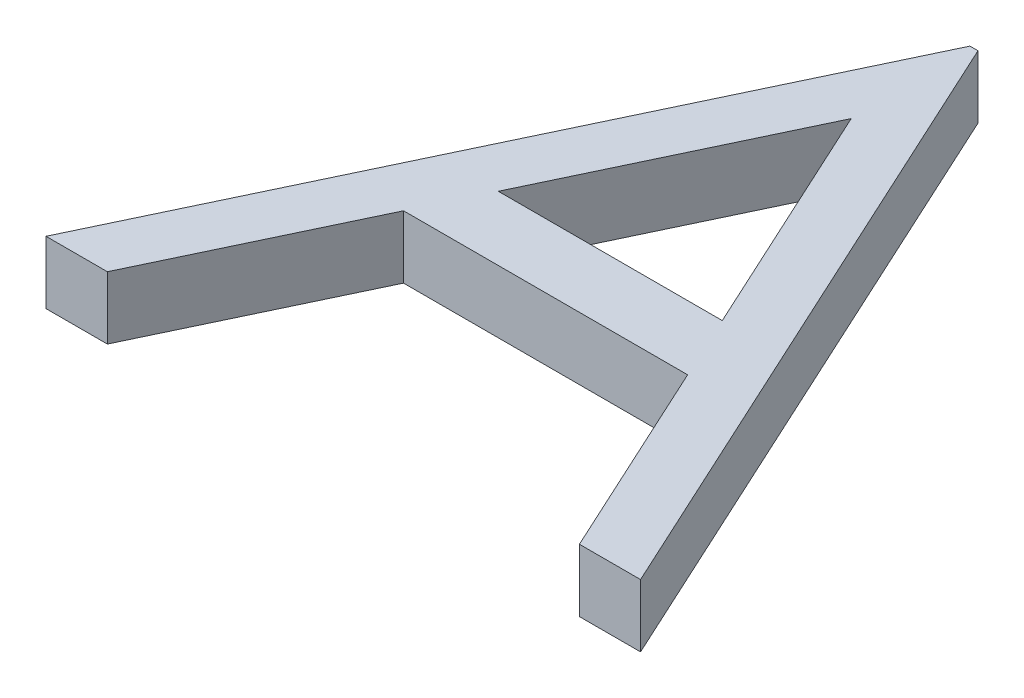
ISO-10303-21;
HEADER;
FILE_DESCRIPTION(('STEP AP214'),'2;1');
FILE_NAME('part.step','',(''),(''),'','','');
FILE_SCHEMA(('AUTOMOTIVE_DESIGN { 1 0 10303 214 1 1 1 1 }'));
ENDSEC;
DATA;
#1=APPLICATION_CONTEXT('core data for automotive mechanical design processes');
#2=APPLICATION_PROTOCOL_DEFINITION('international standard','automotive_design',2000,#1);
#3=PRODUCT_CONTEXT('',#1,'mechanical');
#4=PRODUCT('Part','Part','',(#3));
#5=PRODUCT_RELATED_PRODUCT_CATEGORY('part','',(#4));
#6=PRODUCT_DEFINITION_FORMATION('','',#4);
#7=PRODUCT_DEFINITION_CONTEXT('part definition',#1,'design');
#8=PRODUCT_DEFINITION('design','',#6,#7);
#9=PRODUCT_DEFINITION_SHAPE('','',#8);
#10=(LENGTH_UNIT() NAMED_UNIT(*) SI_UNIT(.MILLI.,.METRE.));
#11=(NAMED_UNIT(*) PLANE_ANGLE_UNIT() SI_UNIT($,.RADIAN.));
#12=(NAMED_UNIT(*) SI_UNIT($,.STERADIAN.) SOLID_ANGLE_UNIT());
#13=UNCERTAINTY_MEASURE_WITH_UNIT(LENGTH_MEASURE(1.E-05),#10,'distance_accuracy_value','');
#14=(GEOMETRIC_REPRESENTATION_CONTEXT(3) GLOBAL_UNCERTAINTY_ASSIGNED_CONTEXT((#13)) GLOBAL_UNIT_ASSIGNED_CONTEXT((#10,
#11,#12)) REPRESENTATION_CONTEXT('',''));
#15=CARTESIAN_POINT('',(0.,0.,0.));
#16=DIRECTION('',(0.,0.,1.));
#17=DIRECTION('',(1.,0.,0.));
#18=AXIS2_PLACEMENT_3D('',#15,#16,#17);
#19=CARTESIAN_POINT('',(0.,2.54,0.));
#20=DIRECTION('',(0.,1.,0.));
#21=DIRECTION('',(0.,0.,1.));
#22=AXIS2_PLACEMENT_3D('',#19,#20,#21);
#23=PLANE('',#22);
#24=DIRECTION('',(1.,0.,0.));
#25=VECTOR('',#24,1.);
#26=CARTESIAN_POINT('',(13.3512820512821,2.54,-25.4));
#27=LINE('',#26,#25);
#28=CARTESIAN_POINT('',(13.3512820512821,2.54,-25.4));
#29=VERTEX_POINT('',#28);
#30=CARTESIAN_POINT('',(13.6769230769231,2.54,-25.4));
#31=VERTEX_POINT('',#30);
#32=EDGE_CURVE('E160',#29,#31,#27,.T.);
#33=ORIENTED_EDGE('',*,*,#32,.F.);
#34=DIRECTION('',(0.428584206872173,0.,-0.903501841514311));
#35=VECTOR('',#34,1.);
#36=CARTESIAN_POINT('',(1.3025641025641,2.54,0.));
#37=LINE('',#36,#35);
#38=CARTESIAN_POINT('',(1.3025641025641,2.54,0.));
#39=VERTEX_POINT('',#38);
#40=EDGE_CURVE('E189',#39,#29,#37,.T.);
#41=ORIENTED_EDGE('',*,*,#40,.F.);
#42=DIRECTION('',(-1.,0.,0.));
#43=VECTOR('',#42,1.);
#44=CARTESIAN_POINT('',(3.79066506410256,2.54,0.));
#45=LINE('',#44,#43);
#46=CARTESIAN_POINT('',(3.79066506410256,2.54,0.));
#47=VERTEX_POINT('',#46);
#48=EDGE_CURVE('E185',#47,#39,#45,.T.);
#49=ORIENTED_EDGE('',*,*,#48,.F.);
#50=DIRECTION('',(-0.428596026355544,0.,0.903496234741594));
#51=VECTOR('',#50,1.);
#52=CARTESIAN_POINT('',(7.6525641025641,2.54,-8.14102564102564));
#53=LINE('',#52,#51);
#54=CARTESIAN_POINT('',(7.6525641025641,2.54,-8.14102564102564));
#55=VERTEX_POINT('',#54);
#56=EDGE_CURVE('E181',#55,#47,#53,.T.);
#57=ORIENTED_EDGE('',*,*,#56,.F.);
#58=DIRECTION('',(-1.,0.,0.));
#59=VECTOR('',#58,1.);
#60=CARTESIAN_POINT('',(19.1670272435897,2.54,-8.14102564102564));
#61=LINE('',#60,#59);
#62=CARTESIAN_POINT('',(19.1670272435897,2.54,-8.14102564102564));
#63=VERTEX_POINT('',#62);
#64=EDGE_CURVE('E177',#63,#55,#61,.T.);
#65=ORIENTED_EDGE('',*,*,#64,.F.);
#66=DIRECTION('',(-0.418842224744608,0.,-0.90805902383655));
#67=VECTOR('',#66,1.);
#68=CARTESIAN_POINT('',(22.9220753205128,2.54,0.));
#69=LINE('',#68,#67);
#70=CARTESIAN_POINT('',(22.9220753205128,2.54,0.));
#71=VERTEX_POINT('',#70);
#72=EDGE_CURVE('E173',#71,#63,#69,.T.);
#73=ORIENTED_EDGE('',*,*,#72,.F.);
#74=DIRECTION('',(-1.,0.,0.));
#75=VECTOR('',#74,1.);
#76=CARTESIAN_POINT('',(25.4,2.54,0.));
#77=LINE('',#76,#75);
#78=CARTESIAN_POINT('',(25.4,2.54,0.));
#79=VERTEX_POINT('',#78);
#80=EDGE_CURVE('E169',#79,#71,#77,.T.);
#81=ORIENTED_EDGE('',*,*,#80,.F.);
#82=DIRECTION('',(0.419058177461747,0.,0.907959384500452));
#83=VECTOR('',#82,1.);
#84=CARTESIAN_POINT('',(13.6769230769231,2.54,-25.4));
#85=LINE('',#84,#83);
#86=EDGE_CURVE('E164',#31,#79,#85,.T.);
#87=ORIENTED_EDGE('',*,*,#86,.F.);
#88=EDGE_LOOP('',(#33,#41,#49,#57,#65,#73,#81,#87));
#89=FACE_BOUND('',#88,.T.);
#90=DIRECTION('',(-0.428351119156279,0.,0.903612371936973));
#91=VECTOR('',#90,1.);
#92=CARTESIAN_POINT('',(13.4886618589744,2.54,-20.4492387820513));
#93=LINE('',#92,#91);
#94=CARTESIAN_POINT('',(13.4886618589744,2.54,-20.4492387820513));
#95=VERTEX_POINT('',#94);
#96=CARTESIAN_POINT('',(8.88898237179487,2.54,-10.7461538461538));
#97=VERTEX_POINT('',#96);
#98=EDGE_CURVE('E133',#95,#97,#93,.T.);
#99=ORIENTED_EDGE('',*,*,#98,.F.);
#100=DIRECTION('',(-0.418997788826975,0.,-0.907987253742092));
#101=VECTOR('',#100,1.);
#102=CARTESIAN_POINT('',(17.9662259615385,2.54,-10.7461538461538));
#103=LINE('',#102,#101);
#104=CARTESIAN_POINT('',(17.9662259615385,2.54,-10.7461538461538));
#105=VERTEX_POINT('',#104);
#106=EDGE_CURVE('E124',#105,#95,#103,.T.);
#107=ORIENTED_EDGE('',*,*,#106,.F.);
#108=DIRECTION('',(1.,0.,0.));
#109=VECTOR('',#108,1.);
#110=CARTESIAN_POINT('',(8.88898237179487,2.54,-10.7461538461538));
#111=LINE('',#110,#109);
#112=EDGE_CURVE('E143',#97,#105,#111,.T.);
#113=ORIENTED_EDGE('',*,*,#112,.F.);
#114=EDGE_LOOP('',(#99,#107,#113));
#115=FACE_BOUND('',#114,.T.);
#116=ADVANCED_FACE('F39',(#89,#115),#23,.T.);
#117=CARTESIAN_POINT('',(0.,0.,0.));
#118=DIRECTION('',(0.,1.,0.));
#119=DIRECTION('',(0.,0.,1.));
#120=AXIS2_PLACEMENT_3D('',#117,#118,#119);
#121=PLANE('',#120);
#122=DIRECTION('',(1.,0.,0.));
#123=VECTOR('',#122,1.);
#124=CARTESIAN_POINT('',(13.3512820512821,0.,-25.4));
#125=LINE('',#124,#123);
#126=CARTESIAN_POINT('',(13.3512820512821,0.,-25.4));
#127=VERTEX_POINT('',#126);
#128=CARTESIAN_POINT('',(13.6769230769231,0.,-25.4));
#129=VERTEX_POINT('',#128);
#130=EDGE_CURVE('E141',#127,#129,#125,.T.);
#131=ORIENTED_EDGE('',*,*,#130,.T.);
#132=DIRECTION('',(0.419058177461747,0.,0.907959384500452));
#133=VECTOR('',#132,1.);
#134=CARTESIAN_POINT('',(13.6769230769231,0.,-25.4));
#135=LINE('',#134,#133);
#136=CARTESIAN_POINT('',(25.4,0.,0.));
#137=VERTEX_POINT('',#136);
#138=EDGE_CURVE('E196',#129,#137,#135,.T.);
#139=ORIENTED_EDGE('',*,*,#138,.T.);
#140=DIRECTION('',(-1.,0.,0.));
#141=VECTOR('',#140,1.);
#142=CARTESIAN_POINT('',(25.4,0.,0.));
#143=LINE('',#142,#141);
#144=CARTESIAN_POINT('',(22.9220753205128,0.,0.));
#145=VERTEX_POINT('',#144);
#146=EDGE_CURVE('E200',#137,#145,#143,.T.);
#147=ORIENTED_EDGE('',*,*,#146,.T.);
#148=DIRECTION('',(-0.418842224744608,0.,-0.90805902383655));
#149=VECTOR('',#148,1.);
#150=CARTESIAN_POINT('',(22.9220753205128,0.,0.));
#151=LINE('',#150,#149);
#152=CARTESIAN_POINT('',(19.1670272435897,0.,-8.14102564102564));
#153=VERTEX_POINT('',#152);
#154=EDGE_CURVE('E204',#145,#153,#151,.T.);
#155=ORIENTED_EDGE('',*,*,#154,.T.);
#156=DIRECTION('',(-1.,0.,0.));
#157=VECTOR('',#156,1.);
#158=CARTESIAN_POINT('',(19.1670272435897,0.,-8.14102564102564));
#159=LINE('',#158,#157);
#160=CARTESIAN_POINT('',(7.6525641025641,0.,-8.14102564102564));
#161=VERTEX_POINT('',#160);
#162=EDGE_CURVE('E208',#153,#161,#159,.T.);
#163=ORIENTED_EDGE('',*,*,#162,.T.);
#164=DIRECTION('',(-0.428596026355544,0.,0.903496234741594));
#165=VECTOR('',#164,1.);
#166=CARTESIAN_POINT('',(7.6525641025641,0.,-8.14102564102564));
#167=LINE('',#166,#165);
#168=CARTESIAN_POINT('',(3.79066506410256,0.,0.));
#169=VERTEX_POINT('',#168);
#170=EDGE_CURVE('E212',#161,#169,#167,.T.);
#171=ORIENTED_EDGE('',*,*,#170,.T.);
#172=DIRECTION('',(-1.,0.,0.));
#173=VECTOR('',#172,1.);
#174=CARTESIAN_POINT('',(3.79066506410256,0.,0.));
#175=LINE('',#174,#173);
#176=CARTESIAN_POINT('',(1.3025641025641,0.,0.));
#177=VERTEX_POINT('',#176);
#178=EDGE_CURVE('E216',#169,#177,#175,.T.);
#179=ORIENTED_EDGE('',*,*,#178,.T.);
#180=DIRECTION('',(0.428584206872173,0.,-0.903501841514311));
#181=VECTOR('',#180,1.);
#182=CARTESIAN_POINT('',(1.3025641025641,0.,0.));
#183=LINE('',#182,#181);
#184=EDGE_CURVE('E165',#177,#127,#183,.T.);
#185=ORIENTED_EDGE('',*,*,#184,.T.);
#186=EDGE_LOOP('',(#131,#139,#147,#155,#163,#171,#179,#185));
#187=FACE_BOUND('',#186,.T.);
#188=DIRECTION('',(-0.418997788826975,0.,-0.907987253742092));
#189=VECTOR('',#188,1.);
#190=CARTESIAN_POINT('',(17.9662259615385,0.,-10.7461538461538));
#191=LINE('',#190,#189);
#192=CARTESIAN_POINT('',(17.9662259615385,0.,-10.7461538461538));
#193=VERTEX_POINT('',#192);
#194=CARTESIAN_POINT('',(13.4886618589744,0.,-20.4492387820513));
#195=VERTEX_POINT('',#194);
#196=EDGE_CURVE('E65',#193,#195,#191,.T.);
#197=ORIENTED_EDGE('',*,*,#196,.T.);
#198=DIRECTION('',(-0.428351119156279,0.,0.903612371936973));
#199=VECTOR('',#198,1.);
#200=CARTESIAN_POINT('',(13.4886618589744,0.,-20.4492387820513));
#201=LINE('',#200,#199);
#202=CARTESIAN_POINT('',(8.88898237179487,0.,-10.7461538461538));
#203=VERTEX_POINT('',#202);
#204=EDGE_CURVE('E139',#195,#203,#201,.T.);
#205=ORIENTED_EDGE('',*,*,#204,.T.);
#206=DIRECTION('',(1.,0.,0.));
#207=VECTOR('',#206,1.);
#208=CARTESIAN_POINT('',(8.88898237179487,0.,-10.7461538461538));
#209=LINE('',#208,#207);
#210=EDGE_CURVE('E134',#203,#193,#209,.T.);
#211=ORIENTED_EDGE('',*,*,#210,.T.);
#212=EDGE_LOOP('',(#197,#205,#211));
#213=FACE_BOUND('',#212,.T.);
#214=ADVANCED_FACE('F248',(#187,#213),#121,.F.);
#215=CARTESIAN_POINT('',(13.3512820512821,2.54,-25.4));
#216=DIRECTION('',(0.,0.,-1.));
#217=DIRECTION('',(-1.,0.,0.));
#218=AXIS2_PLACEMENT_3D('',#215,#216,#217);
#219=PLANE('',#218);
#220=ORIENTED_EDGE('',*,*,#130,.F.);
#221=DIRECTION('',(0.,-1.,0.));
#222=VECTOR('',#221,1.);
#223=CARTESIAN_POINT('',(13.3512820512821,2.54,-25.4));
#224=LINE('',#223,#222);
#225=EDGE_CURVE('E11',#29,#127,#224,.T.);
#226=ORIENTED_EDGE('',*,*,#225,.F.);
#227=ORIENTED_EDGE('',*,*,#32,.T.);
#228=DIRECTION('',(0.,-1.,0.));
#229=VECTOR('',#228,1.);
#230=CARTESIAN_POINT('',(13.6769230769231,2.54,-25.4));
#231=LINE('',#230,#229);
#232=EDGE_CURVE('E43',#31,#129,#231,.T.);
#233=ORIENTED_EDGE('',*,*,#232,.T.);
#234=EDGE_LOOP('',(#220,#226,#227,#233));
#235=FACE_BOUND('',#234,.T.);
#236=ADVANCED_FACE('F41',(#235),#219,.T.);
#237=CARTESIAN_POINT('',(1.3025641025641,2.54,0.));
#238=DIRECTION('',(-0.903501841514311,0.,-0.428584206872173));
#239=DIRECTION('',(-0.428584206872173,0.,0.903501841514311));
#240=AXIS2_PLACEMENT_3D('',#237,#238,#239);
#241=PLANE('',#240);
#242=ORIENTED_EDGE('',*,*,#184,.F.);
#243=DIRECTION('',(0.,-1.,0.));
#244=VECTOR('',#243,1.);
#245=CARTESIAN_POINT('',(1.3025641025641,2.54,0.));
#246=LINE('',#245,#244);
#247=EDGE_CURVE('E49',#39,#177,#246,.T.);
#248=ORIENTED_EDGE('',*,*,#247,.F.);
#249=ORIENTED_EDGE('',*,*,#40,.T.);
#250=ORIENTED_EDGE('',*,*,#225,.T.);
#251=EDGE_LOOP('',(#242,#248,#249,#250));
#252=FACE_BOUND('',#251,.T.);
#253=ADVANCED_FACE('F253',(#252),#241,.T.);
#254=CARTESIAN_POINT('',(3.79066506410256,2.54,0.));
#255=DIRECTION('',(0.,0.,1.));
#256=DIRECTION('',(1.,0.,0.));
#257=AXIS2_PLACEMENT_3D('',#254,#255,#256);
#258=PLANE('',#257);
#259=ORIENTED_EDGE('',*,*,#178,.F.);
#260=DIRECTION('',(0.,-1.,0.));
#261=VECTOR('',#260,1.);
#262=CARTESIAN_POINT('',(3.79066506410256,2.54,0.));
#263=LINE('',#262,#261);
#264=EDGE_CURVE('E225',#47,#169,#263,.T.);
#265=ORIENTED_EDGE('',*,*,#264,.F.);
#266=ORIENTED_EDGE('',*,*,#48,.T.);
#267=ORIENTED_EDGE('',*,*,#247,.T.);
#268=EDGE_LOOP('',(#259,#265,#266,#267));
#269=FACE_BOUND('',#268,.T.);
#270=ADVANCED_FACE('F273',(#269),#258,.T.);
#271=CARTESIAN_POINT('',(7.6525641025641,2.54,-8.14102564102564));
#272=DIRECTION('',(0.903496234741594,0.,0.428596026355544));
#273=DIRECTION('',(0.428596026355544,0.,-0.903496234741594));
#274=AXIS2_PLACEMENT_3D('',#271,#272,#273);
#275=PLANE('',#274);
#276=ORIENTED_EDGE('',*,*,#170,.F.);
#277=DIRECTION('',(0.,-1.,0.));
#278=VECTOR('',#277,1.);
#279=CARTESIAN_POINT('',(7.6525641025641,2.54,-8.14102564102564));
#280=LINE('',#279,#278);
#281=EDGE_CURVE('E228',#55,#161,#280,.T.);
#282=ORIENTED_EDGE('',*,*,#281,.F.);
#283=ORIENTED_EDGE('',*,*,#56,.T.);
#284=ORIENTED_EDGE('',*,*,#264,.T.);
#285=EDGE_LOOP('',(#276,#282,#283,#284));
#286=FACE_BOUND('',#285,.T.);
#287=ADVANCED_FACE('F271',(#286),#275,.T.);
#288=CARTESIAN_POINT('',(19.1670272435897,2.54,-8.14102564102564));
#289=DIRECTION('',(0.,0.,1.));
#290=DIRECTION('',(1.,0.,0.));
#291=AXIS2_PLACEMENT_3D('',#288,#289,#290);
#292=PLANE('',#291);
#293=ORIENTED_EDGE('',*,*,#162,.F.);
#294=DIRECTION('',(0.,-1.,0.));
#295=VECTOR('',#294,1.);
#296=CARTESIAN_POINT('',(19.1670272435897,2.54,-8.14102564102564));
#297=LINE('',#296,#295);
#298=EDGE_CURVE('E231',#63,#153,#297,.T.);
#299=ORIENTED_EDGE('',*,*,#298,.F.);
#300=ORIENTED_EDGE('',*,*,#64,.T.);
#301=ORIENTED_EDGE('',*,*,#281,.T.);
#302=EDGE_LOOP('',(#293,#299,#300,#301));
#303=FACE_BOUND('',#302,.T.);
#304=ADVANCED_FACE('F267',(#303),#292,.T.);
#305=CARTESIAN_POINT('',(22.9220753205128,2.54,0.));
#306=DIRECTION('',(-0.908059023836549,0.,0.418842224744608));
#307=DIRECTION('',(0.418842224744608,0.,0.908059023836549));
#308=AXIS2_PLACEMENT_3D('',#305,#306,#307);
#309=PLANE('',#308);
#310=ORIENTED_EDGE('',*,*,#154,.F.);
#311=DIRECTION('',(0.,-1.,0.));
#312=VECTOR('',#311,1.);
#313=CARTESIAN_POINT('',(22.9220753205128,2.54,0.));
#314=LINE('',#313,#312);
#315=EDGE_CURVE('E234',#71,#145,#314,.T.);
#316=ORIENTED_EDGE('',*,*,#315,.F.);
#317=ORIENTED_EDGE('',*,*,#72,.T.);
#318=ORIENTED_EDGE('',*,*,#298,.T.);
#319=EDGE_LOOP('',(#310,#316,#317,#318));
#320=FACE_BOUND('',#319,.T.);
#321=ADVANCED_FACE('F265',(#320),#309,.T.);
#322=CARTESIAN_POINT('',(25.4,2.54,0.));
#323=DIRECTION('',(0.,0.,1.));
#324=DIRECTION('',(1.,0.,0.));
#325=AXIS2_PLACEMENT_3D('',#322,#323,#324);
#326=PLANE('',#325);
#327=ORIENTED_EDGE('',*,*,#146,.F.);
#328=DIRECTION('',(0.,-1.,0.));
#329=VECTOR('',#328,1.);
#330=CARTESIAN_POINT('',(25.4,2.54,0.));
#331=LINE('',#330,#329);
#332=EDGE_CURVE('E236',#79,#137,#331,.T.);
#333=ORIENTED_EDGE('',*,*,#332,.F.);
#334=ORIENTED_EDGE('',*,*,#80,.T.);
#335=ORIENTED_EDGE('',*,*,#315,.T.);
#336=EDGE_LOOP('',(#327,#333,#334,#335));
#337=FACE_BOUND('',#336,.T.);
#338=ADVANCED_FACE('F261',(#337),#326,.T.);
#339=CARTESIAN_POINT('',(13.6769230769231,2.54,-25.4));
#340=DIRECTION('',(0.907959384500452,0.,-0.419058177461747));
#341=DIRECTION('',(-0.419058177461747,0.,-0.907959384500452));
#342=AXIS2_PLACEMENT_3D('',#339,#340,#341);
#343=PLANE('',#342);
#344=ORIENTED_EDGE('',*,*,#138,.F.);
#345=ORIENTED_EDGE('',*,*,#232,.F.);
#346=ORIENTED_EDGE('',*,*,#86,.T.);
#347=ORIENTED_EDGE('',*,*,#332,.T.);
#348=EDGE_LOOP('',(#344,#345,#346,#347));
#349=FACE_BOUND('',#348,.T.);
#350=ADVANCED_FACE('F246',(#349),#343,.T.);
#351=CARTESIAN_POINT('',(17.9662259615385,2.54,-10.7461538461538));
#352=DIRECTION('',(-0.907987253742092,0.,0.418997788826975));
#353=DIRECTION('',(0.418997788826975,0.,0.907987253742092));
#354=AXIS2_PLACEMENT_3D('',#351,#352,#353);
#355=PLANE('',#354);
#356=ORIENTED_EDGE('',*,*,#196,.F.);
#357=DIRECTION('',(0.,-1.,0.));
#358=VECTOR('',#357,1.);
#359=CARTESIAN_POINT('',(17.9662259615385,2.54,-10.7461538461538));
#360=LINE('',#359,#358);
#361=EDGE_CURVE('E128',#105,#193,#360,.T.);
#362=ORIENTED_EDGE('',*,*,#361,.F.);
#363=ORIENTED_EDGE('',*,*,#106,.T.);
#364=DIRECTION('',(0.,-1.,0.));
#365=VECTOR('',#364,1.);
#366=CARTESIAN_POINT('',(13.4886618589744,2.54,-20.4492387820513));
#367=LINE('',#366,#365);
#368=EDGE_CURVE('E127',#95,#195,#367,.T.);
#369=ORIENTED_EDGE('',*,*,#368,.T.);
#370=EDGE_LOOP('',(#356,#362,#363,#369));
#371=FACE_BOUND('',#370,.T.);
#372=ADVANCED_FACE('F126',(#371),#355,.T.);
#373=CARTESIAN_POINT('',(13.4886618589744,2.54,-20.4492387820513));
#374=DIRECTION('',(0.903612371936974,0.,0.428351119156279));
#375=DIRECTION('',(0.428351119156279,0.,-0.903612371936974));
#376=AXIS2_PLACEMENT_3D('',#373,#374,#375);
#377=PLANE('',#376);
#378=ORIENTED_EDGE('',*,*,#204,.F.);
#379=ORIENTED_EDGE('',*,*,#368,.F.);
#380=ORIENTED_EDGE('',*,*,#98,.T.);
#381=DIRECTION('',(0.,-1.,0.));
#382=VECTOR('',#381,1.);
#383=CARTESIAN_POINT('',(8.88898237179487,2.54,-10.7461538461538));
#384=LINE('',#383,#382);
#385=EDGE_CURVE('E57',#97,#203,#384,.T.);
#386=ORIENTED_EDGE('',*,*,#385,.T.);
#387=EDGE_LOOP('',(#378,#379,#380,#386));
#388=FACE_BOUND('',#387,.T.);
#389=ADVANCED_FACE('F137',(#388),#377,.T.);
#390=CARTESIAN_POINT('',(8.88898237179487,2.54,-10.7461538461538));
#391=DIRECTION('',(0.,0.,-1.));
#392=DIRECTION('',(-1.,0.,0.));
#393=AXIS2_PLACEMENT_3D('',#390,#391,#392);
#394=PLANE('',#393);
#395=ORIENTED_EDGE('',*,*,#210,.F.);
#396=ORIENTED_EDGE('',*,*,#385,.F.);
#397=ORIENTED_EDGE('',*,*,#112,.T.);
#398=ORIENTED_EDGE('',*,*,#361,.T.);
#399=EDGE_LOOP('',(#395,#396,#397,#398));
#400=FACE_BOUND('',#399,.T.);
#401=ADVANCED_FACE('F293',(#400),#394,.T.);
#402=CLOSED_SHELL('',(#116,#214,#236,#253,#270,#287,#304,#321,#338,#350,#372,#389,#401));
#403=MANIFOLD_SOLID_BREP('B2',#402);
#404=ADVANCED_BREP_SHAPE_REPRESENTATION('',(#18,#403),#14);
#405=SHAPE_DEFINITION_REPRESENTATION(#9,#404);
ENDSEC;
END-ISO-10303-21;
